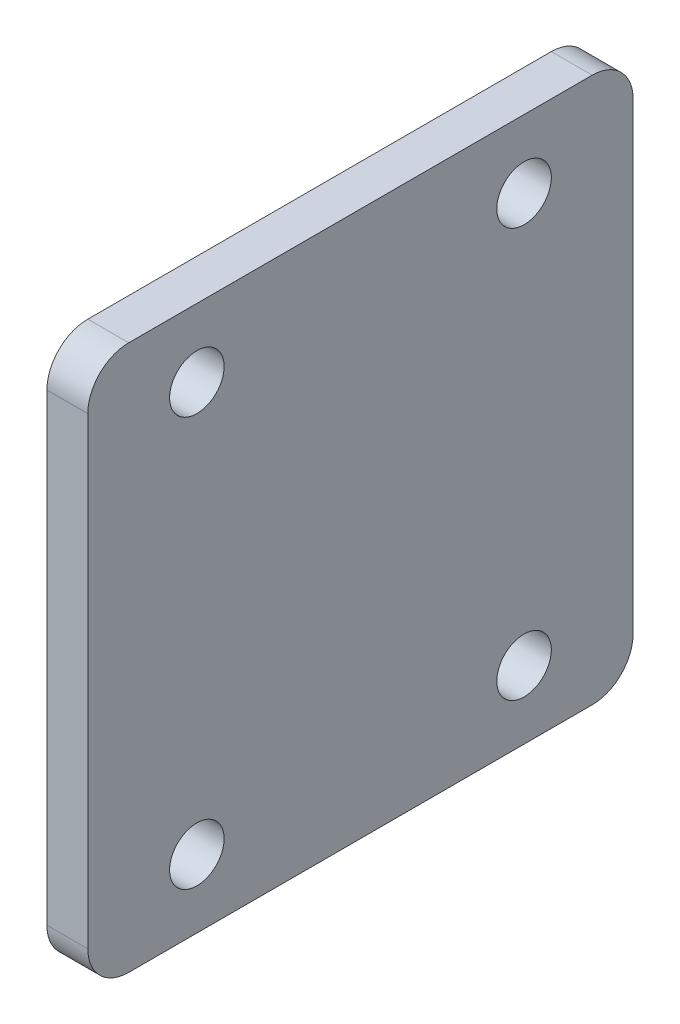
ISO-10303-21;
HEADER;
FILE_DESCRIPTION(('STEP AP214'),'2;1');
FILE_NAME('part.step','',(''),(''),'','','');
FILE_SCHEMA(('AUTOMOTIVE_DESIGN { 1 0 10303 214 1 1 1 1 }'));
ENDSEC;
DATA;
#1=APPLICATION_CONTEXT('core data for automotive mechanical design processes');
#2=APPLICATION_PROTOCOL_DEFINITION('international standard','automotive_design',2000,#1);
#3=PRODUCT_CONTEXT('',#1,'mechanical');
#4=PRODUCT('Part','Part','',(#3));
#5=PRODUCT_RELATED_PRODUCT_CATEGORY('part','',(#4));
#6=PRODUCT_DEFINITION_FORMATION('','',#4);
#7=PRODUCT_DEFINITION_CONTEXT('part definition',#1,'design');
#8=PRODUCT_DEFINITION('design','',#6,#7);
#9=PRODUCT_DEFINITION_SHAPE('','',#8);
#10=(LENGTH_UNIT() NAMED_UNIT(*) SI_UNIT(.MILLI.,.METRE.));
#11=(NAMED_UNIT(*) PLANE_ANGLE_UNIT() SI_UNIT($,.RADIAN.));
#12=(NAMED_UNIT(*) SI_UNIT($,.STERADIAN.) SOLID_ANGLE_UNIT());
#13=UNCERTAINTY_MEASURE_WITH_UNIT(LENGTH_MEASURE(1.E-05),#10,'distance_accuracy_value','');
#14=(GEOMETRIC_REPRESENTATION_CONTEXT(3) GLOBAL_UNCERTAINTY_ASSIGNED_CONTEXT((#13)) GLOBAL_UNIT_ASSIGNED_CONTEXT((#10,
#11,#12)) REPRESENTATION_CONTEXT('',''));
#15=CARTESIAN_POINT('',(0.,0.,0.));
#16=DIRECTION('',(0.,0.,1.));
#17=DIRECTION('',(1.,0.,0.));
#18=AXIS2_PLACEMENT_3D('',#15,#16,#17);
#19=CARTESIAN_POINT('',(-29.0517455341106,1220.26171759858,-56.1631389664354));
#20=DIRECTION('',(0.,0.,1.));
#21=DIRECTION('',(0.,-1.,0.));
#22=AXIS2_PLACEMENT_3D('',#19,#20,#21);
#23=PLANE('',#22);
#24=DIRECTION('',(0.,-1.,0.));
#25=VECTOR('',#24,1.);
#26=CARTESIAN_POINT('',(-26.0517455341106,1220.26171759858,-56.1631389664354));
#27=LINE('',#26,#25);
#28=CARTESIAN_POINT('',(-26.0517455341106,1217.26171759858,-56.1631389664354));
#29=VERTEX_POINT('',#28);
#30=CARTESIAN_POINT('',(-26.0517455341106,1183.26171759858,-56.1631389664354));
#31=VERTEX_POINT('',#30);
#32=EDGE_CURVE('E128',#29,#31,#27,.T.);
#33=ORIENTED_EDGE('',*,*,#32,.T.);
#34=DIRECTION('',(1.,0.,0.));
#35=VECTOR('',#34,1.);
#36=CARTESIAN_POINT('',(-29.0517455341106,1183.26171759858,-56.1631389664354));
#37=LINE('',#36,#35);
#38=CARTESIAN_POINT('',(-29.0517455341106,1183.26171759858,-56.1631389664354));
#39=VERTEX_POINT('',#38);
#40=EDGE_CURVE('E151',#31,#39,#37,.F.);
#41=ORIENTED_EDGE('',*,*,#40,.T.);
#42=DIRECTION('',(0.,-1.,0.));
#43=VECTOR('',#42,1.);
#44=CARTESIAN_POINT('',(-29.0517455341106,1220.26171759858,-56.1631389664354));
#45=LINE('',#44,#43);
#46=CARTESIAN_POINT('',(-29.0517455341106,1217.26171759858,-56.1631389664354));
#47=VERTEX_POINT('',#46);
#48=EDGE_CURVE('E126',#47,#39,#45,.T.);
#49=ORIENTED_EDGE('',*,*,#48,.F.);
#50=DIRECTION('',(1.,0.,0.));
#51=VECTOR('',#50,1.);
#52=CARTESIAN_POINT('',(-29.0517455341106,1217.26171759858,-56.1631389664354));
#53=LINE('',#52,#51);
#54=EDGE_CURVE('E148',#47,#29,#53,.T.);
#55=ORIENTED_EDGE('',*,*,#54,.T.);
#56=EDGE_LOOP('',(#33,#41,#49,#55));
#57=FACE_BOUND('',#56,.T.);
#58=ADVANCED_FACE('F33',(#57),#23,.F.);
#59=CARTESIAN_POINT('',(-29.0517455341106,1180.26171759858,-56.1631389664354));
#60=DIRECTION('',(0.,1.,0.));
#61=DIRECTION('',(0.,0.,1.));
#62=AXIS2_PLACEMENT_3D('',#59,#60,#61);
#63=PLANE('',#62);
#64=DIRECTION('',(0.,0.,1.));
#65=VECTOR('',#64,1.);
#66=CARTESIAN_POINT('',(-26.0517455341106,1180.26171759858,-56.1631389664354));
#67=LINE('',#66,#65);
#68=CARTESIAN_POINT('',(-26.0517455341106,1180.26171759858,-53.1631389664354));
#69=VERTEX_POINT('',#68);
#70=CARTESIAN_POINT('',(-26.0517455341106,1180.26171759858,-19.1631389664354));
#71=VERTEX_POINT('',#70);
#72=EDGE_CURVE('E124',#69,#71,#67,.T.);
#73=ORIENTED_EDGE('',*,*,#72,.T.);
#74=DIRECTION('',(1.,0.,0.));
#75=VECTOR('',#74,1.);
#76=CARTESIAN_POINT('',(-29.0517455341106,1180.26171759858,-19.1631389664354));
#77=LINE('',#76,#75);
#78=CARTESIAN_POINT('',(-29.0517455341106,1180.26171759858,-19.1631389664354));
#79=VERTEX_POINT('',#78);
#80=EDGE_CURVE('E103',#71,#79,#77,.F.);
#81=ORIENTED_EDGE('',*,*,#80,.T.);
#82=DIRECTION('',(0.,0.,1.));
#83=VECTOR('',#82,1.);
#84=CARTESIAN_POINT('',(-29.0517455341106,1180.26171759858,-56.1631389664354));
#85=LINE('',#84,#83);
#86=CARTESIAN_POINT('',(-29.0517455341106,1180.26171759858,-53.1631389664354));
#87=VERTEX_POINT('',#86);
#88=EDGE_CURVE('E167',#87,#79,#85,.T.);
#89=ORIENTED_EDGE('',*,*,#88,.F.);
#90=DIRECTION('',(1.,0.,0.));
#91=VECTOR('',#90,1.);
#92=CARTESIAN_POINT('',(-29.0517455341106,1180.26171759858,-53.1631389664354));
#93=LINE('',#92,#91);
#94=EDGE_CURVE('E108',#87,#69,#93,.T.);
#95=ORIENTED_EDGE('',*,*,#94,.T.);
#96=EDGE_LOOP('',(#73,#81,#89,#95));
#97=FACE_BOUND('',#96,.T.);
#98=ADVANCED_FACE('F217',(#97),#63,.F.);
#99=CARTESIAN_POINT('',(-29.0517455341106,1220.26171759858,-16.1631389664354));
#100=DIRECTION('',(0.,0.,-1.));
#101=DIRECTION('',(0.,1.,0.));
#102=AXIS2_PLACEMENT_3D('',#99,#100,#101);
#103=PLANE('',#102);
#104=DIRECTION('',(0.,1.,0.));
#105=VECTOR('',#104,1.);
#106=CARTESIAN_POINT('',(-29.0517455341106,1220.26171759858,-16.1631389664354));
#107=LINE('',#106,#105);
#108=CARTESIAN_POINT('',(-29.0517455341106,1183.26171759858,-16.1631389664354));
#109=VERTEX_POINT('',#108);
#110=CARTESIAN_POINT('',(-29.0517455341106,1217.26171759858,-16.1631389664354));
#111=VERTEX_POINT('',#110);
#112=EDGE_CURVE('E117',#109,#111,#107,.T.);
#113=ORIENTED_EDGE('',*,*,#112,.F.);
#114=DIRECTION('',(1.,0.,0.));
#115=VECTOR('',#114,1.);
#116=CARTESIAN_POINT('',(-29.0517455341106,1183.26171759858,-16.1631389664354));
#117=LINE('',#116,#115);
#118=CARTESIAN_POINT('',(-26.0517455341106,1183.26171759858,-16.1631389664354));
#119=VERTEX_POINT('',#118);
#120=EDGE_CURVE('E102',#109,#119,#117,.T.);
#121=ORIENTED_EDGE('',*,*,#120,.T.);
#122=DIRECTION('',(0.,1.,0.));
#123=VECTOR('',#122,1.);
#124=CARTESIAN_POINT('',(-26.0517455341106,1220.26171759858,-16.1631389664354));
#125=LINE('',#124,#123);
#126=CARTESIAN_POINT('',(-26.0517455341106,1217.26171759858,-16.1631389664354));
#127=VERTEX_POINT('',#126);
#128=EDGE_CURVE('E115',#119,#127,#125,.T.);
#129=ORIENTED_EDGE('',*,*,#128,.T.);
#130=DIRECTION('',(1.,0.,0.));
#131=VECTOR('',#130,1.);
#132=CARTESIAN_POINT('',(-29.0517455341106,1217.26171759858,-16.1631389664354));
#133=LINE('',#132,#131);
#134=EDGE_CURVE('E119',#127,#111,#133,.F.);
#135=ORIENTED_EDGE('',*,*,#134,.T.);
#136=EDGE_LOOP('',(#113,#121,#129,#135));
#137=FACE_BOUND('',#136,.T.);
#138=ADVANCED_FACE('F114',(#137),#103,.F.);
#139=CARTESIAN_POINT('',(-29.0517455341106,1220.26171759858,-56.1631389664354));
#140=DIRECTION('',(0.,-1.,0.));
#141=DIRECTION('',(0.,0.,-1.));
#142=AXIS2_PLACEMENT_3D('',#139,#140,#141);
#143=PLANE('',#142);
#144=DIRECTION('',(0.,0.,-1.));
#145=VECTOR('',#144,1.);
#146=CARTESIAN_POINT('',(-26.0517455341106,1220.26171759858,-56.1631389664354));
#147=LINE('',#146,#145);
#148=CARTESIAN_POINT('',(-26.0517455341106,1220.26171759858,-19.1631389664354));
#149=VERTEX_POINT('',#148);
#150=CARTESIAN_POINT('',(-26.0517455341106,1220.26171759858,-53.1631389664354));
#151=VERTEX_POINT('',#150);
#152=EDGE_CURVE('E123',#149,#151,#147,.T.);
#153=ORIENTED_EDGE('',*,*,#152,.T.);
#154=DIRECTION('',(1.,0.,0.));
#155=VECTOR('',#154,1.);
#156=CARTESIAN_POINT('',(-29.0517455341106,1220.26171759858,-53.1631389664354));
#157=LINE('',#156,#155);
#158=CARTESIAN_POINT('',(-29.0517455341106,1220.26171759858,-53.1631389664354));
#159=VERTEX_POINT('',#158);
#160=EDGE_CURVE('E11',#151,#159,#157,.F.);
#161=ORIENTED_EDGE('',*,*,#160,.T.);
#162=DIRECTION('',(0.,0.,-1.));
#163=VECTOR('',#162,1.);
#164=CARTESIAN_POINT('',(-29.0517455341106,1220.26171759858,-56.1631389664354));
#165=LINE('',#164,#163);
#166=CARTESIAN_POINT('',(-29.0517455341106,1220.26171759858,-19.1631389664354));
#167=VERTEX_POINT('',#166);
#168=EDGE_CURVE('E132',#167,#159,#165,.T.);
#169=ORIENTED_EDGE('',*,*,#168,.F.);
#170=DIRECTION('',(1.,0.,0.));
#171=VECTOR('',#170,1.);
#172=CARTESIAN_POINT('',(-29.0517455341106,1220.26171759858,-19.1631389664354));
#173=LINE('',#172,#171);
#174=EDGE_CURVE('E41',#167,#149,#173,.T.);
#175=ORIENTED_EDGE('',*,*,#174,.T.);
#176=EDGE_LOOP('',(#153,#161,#169,#175));
#177=FACE_BOUND('',#176,.T.);
#178=ADVANCED_FACE('F154',(#177),#143,.F.);
#179=CARTESIAN_POINT('',(-29.0517455341106,1180.26171759858,-56.1631389664354));
#180=DIRECTION('',(-1.,0.,0.));
#181=DIRECTION('',(0.,0.,1.));
#182=AXIS2_PLACEMENT_3D('',#179,#180,#181);
#183=PLANE('',#182);
#184=CARTESIAN_POINT('',(-29.0517455341106,1185.26171759858,-48.1631389664354));
#185=DIRECTION('',(-1.,0.,0.));
#186=DIRECTION('',(0.,0.,1.));
#187=AXIS2_PLACEMENT_3D('',#184,#185,#186);
#188=CIRCLE('',#187,2.);
#189=CARTESIAN_POINT('',(-29.0517455341106,1185.26171759858,-46.1631389664354));
#190=VERTEX_POINT('',#189);
#191=EDGE_CURVE('E199',#190,#190,#188,.T.);
#192=ORIENTED_EDGE('',*,*,#191,.F.);
#193=EDGE_LOOP('',(#192));
#194=FACE_BOUND('',#193,.T.);
#195=CARTESIAN_POINT('',(-29.0517455341106,1185.26171759858,-24.1631389664354));
#196=DIRECTION('',(-1.,0.,0.));
#197=DIRECTION('',(0.,0.,1.));
#198=AXIS2_PLACEMENT_3D('',#195,#196,#197);
#199=CIRCLE('',#198,2.);
#200=CARTESIAN_POINT('',(-29.0517455341106,1185.26171759858,-22.1631389664354));
#201=VERTEX_POINT('',#200);
#202=EDGE_CURVE('E193',#201,#201,#199,.T.);
#203=ORIENTED_EDGE('',*,*,#202,.F.);
#204=EDGE_LOOP('',(#203));
#205=FACE_BOUND('',#204,.T.);
#206=CARTESIAN_POINT('',(-29.0517455341106,1215.26171759858,-24.1631389664354));
#207=DIRECTION('',(-1.,0.,0.));
#208=DIRECTION('',(0.,0.,1.));
#209=AXIS2_PLACEMENT_3D('',#206,#207,#208);
#210=CIRCLE('',#209,2.);
#211=CARTESIAN_POINT('',(-29.0517455341106,1215.26171759858,-22.1631389664354));
#212=VERTEX_POINT('',#211);
#213=EDGE_CURVE('E185',#212,#212,#210,.T.);
#214=ORIENTED_EDGE('',*,*,#213,.F.);
#215=EDGE_LOOP('',(#214));
#216=FACE_BOUND('',#215,.T.);
#217=CARTESIAN_POINT('',(-29.0517455341106,1215.26171759858,-48.1631389664354));
#218=DIRECTION('',(-1.,0.,0.));
#219=DIRECTION('',(0.,0.,1.));
#220=AXIS2_PLACEMENT_3D('',#217,#218,#219);
#221=CIRCLE('',#220,2.);
#222=CARTESIAN_POINT('',(-29.0517455341106,1215.26171759858,-46.1631389664354));
#223=VERTEX_POINT('',#222);
#224=EDGE_CURVE('E177',#223,#223,#221,.T.);
#225=ORIENTED_EDGE('',*,*,#224,.F.);
#226=EDGE_LOOP('',(#225));
#227=FACE_BOUND('',#226,.T.);
#228=ORIENTED_EDGE('',*,*,#88,.T.);
#229=CARTESIAN_POINT('',(-29.0517455341106,1183.26171759858,-19.1631389664354));
#230=DIRECTION('',(-1.,0.,0.));
#231=DIRECTION('',(0.,0.,1.));
#232=AXIS2_PLACEMENT_3D('',#229,#230,#231);
#233=CIRCLE('',#232,3.);
#234=EDGE_CURVE('E146',#79,#109,#233,.T.);
#235=ORIENTED_EDGE('',*,*,#234,.T.);
#236=ORIENTED_EDGE('',*,*,#112,.T.);
#237=CARTESIAN_POINT('',(-29.0517455341106,1217.26171759858,-19.1631389664354));
#238=DIRECTION('',(-1.,0.,0.));
#239=DIRECTION('',(0.,0.,1.));
#240=AXIS2_PLACEMENT_3D('',#237,#238,#239);
#241=CIRCLE('',#240,3.);
#242=EDGE_CURVE('E53',#111,#167,#241,.T.);
#243=ORIENTED_EDGE('',*,*,#242,.T.);
#244=ORIENTED_EDGE('',*,*,#168,.T.);
#245=CARTESIAN_POINT('',(-29.0517455341106,1217.26171759858,-53.1631389664354));
#246=DIRECTION('',(-1.,0.,0.));
#247=DIRECTION('',(0.,0.,1.));
#248=AXIS2_PLACEMENT_3D('',#245,#246,#247);
#249=CIRCLE('',#248,3.);
#250=EDGE_CURVE('E142',#159,#47,#249,.T.);
#251=ORIENTED_EDGE('',*,*,#250,.T.);
#252=ORIENTED_EDGE('',*,*,#48,.T.);
#253=CARTESIAN_POINT('',(-29.0517455341106,1183.26171759858,-53.1631389664354));
#254=DIRECTION('',(-1.,0.,0.));
#255=DIRECTION('',(0.,0.,1.));
#256=AXIS2_PLACEMENT_3D('',#253,#254,#255);
#257=CIRCLE('',#256,3.);
#258=EDGE_CURVE('E144',#39,#87,#257,.T.);
#259=ORIENTED_EDGE('',*,*,#258,.T.);
#260=EDGE_LOOP('',(#228,#235,#236,#243,#244,#251,#252,#259));
#261=FACE_BOUND('',#260,.T.);
#262=ADVANCED_FACE('F206',(#194,#205,#216,#227,#261),#183,.T.);
#263=CARTESIAN_POINT('',(-26.0517455341106,1180.26171759858,-56.1631389664354));
#264=DIRECTION('',(-1.,0.,0.));
#265=DIRECTION('',(0.,0.,1.));
#266=AXIS2_PLACEMENT_3D('',#263,#264,#265);
#267=PLANE('',#266);
#268=CARTESIAN_POINT('',(-26.0517455341106,1185.26171759858,-48.1631389664354));
#269=DIRECTION('',(-1.,0.,0.));
#270=DIRECTION('',(0.,0.,1.));
#271=AXIS2_PLACEMENT_3D('',#268,#269,#270);
#272=CIRCLE('',#271,2.);
#273=CARTESIAN_POINT('',(-26.0517455341106,1185.26171759858,-46.1631389664354));
#274=VERTEX_POINT('',#273);
#275=EDGE_CURVE('E196',#274,#274,#272,.F.);
#276=ORIENTED_EDGE('',*,*,#275,.F.);
#277=EDGE_LOOP('',(#276));
#278=FACE_BOUND('',#277,.T.);
#279=CARTESIAN_POINT('',(-26.0517455341106,1185.26171759858,-24.1631389664354));
#280=DIRECTION('',(-1.,0.,0.));
#281=DIRECTION('',(0.,0.,1.));
#282=AXIS2_PLACEMENT_3D('',#279,#280,#281);
#283=CIRCLE('',#282,2.);
#284=CARTESIAN_POINT('',(-26.0517455341106,1185.26171759858,-22.1631389664354));
#285=VERTEX_POINT('',#284);
#286=EDGE_CURVE('E190',#285,#285,#283,.F.);
#287=ORIENTED_EDGE('',*,*,#286,.F.);
#288=EDGE_LOOP('',(#287));
#289=FACE_BOUND('',#288,.T.);
#290=CARTESIAN_POINT('',(-26.0517455341106,1215.26171759858,-24.1631389664354));
#291=DIRECTION('',(-1.,0.,0.));
#292=DIRECTION('',(0.,0.,1.));
#293=AXIS2_PLACEMENT_3D('',#290,#291,#292);
#294=CIRCLE('',#293,2.);
#295=CARTESIAN_POINT('',(-26.0517455341106,1215.26171759858,-22.1631389664354));
#296=VERTEX_POINT('',#295);
#297=EDGE_CURVE('E181',#296,#296,#294,.F.);
#298=ORIENTED_EDGE('',*,*,#297,.F.);
#299=EDGE_LOOP('',(#298));
#300=FACE_BOUND('',#299,.T.);
#301=CARTESIAN_POINT('',(-26.0517455341106,1215.26171759858,-48.1631389664354));
#302=DIRECTION('',(-1.,0.,0.));
#303=DIRECTION('',(0.,0.,1.));
#304=AXIS2_PLACEMENT_3D('',#301,#302,#303);
#305=CIRCLE('',#304,2.);
#306=CARTESIAN_POINT('',(-26.0517455341106,1215.26171759858,-46.1631389664354));
#307=VERTEX_POINT('',#306);
#308=EDGE_CURVE('E172',#307,#307,#305,.F.);
#309=ORIENTED_EDGE('',*,*,#308,.F.);
#310=EDGE_LOOP('',(#309));
#311=FACE_BOUND('',#310,.T.);
#312=ORIENTED_EDGE('',*,*,#128,.F.);
#313=CARTESIAN_POINT('',(-26.0517455341106,1183.26171759858,-19.1631389664354));
#314=DIRECTION('',(-1.,0.,0.));
#315=DIRECTION('',(0.,0.,1.));
#316=AXIS2_PLACEMENT_3D('',#313,#314,#315);
#317=CIRCLE('',#316,3.);
#318=EDGE_CURVE('E98',#119,#71,#317,.F.);
#319=ORIENTED_EDGE('',*,*,#318,.T.);
#320=ORIENTED_EDGE('',*,*,#72,.F.);
#321=CARTESIAN_POINT('',(-26.0517455341106,1183.26171759858,-53.1631389664354));
#322=DIRECTION('',(-1.,0.,0.));
#323=DIRECTION('',(0.,0.,1.));
#324=AXIS2_PLACEMENT_3D('',#321,#322,#323);
#325=CIRCLE('',#324,3.);
#326=EDGE_CURVE('E109',#69,#31,#325,.F.);
#327=ORIENTED_EDGE('',*,*,#326,.T.);
#328=ORIENTED_EDGE('',*,*,#32,.F.);
#329=CARTESIAN_POINT('',(-26.0517455341106,1217.26171759858,-53.1631389664354));
#330=DIRECTION('',(-1.,0.,0.));
#331=DIRECTION('',(0.,0.,1.));
#332=AXIS2_PLACEMENT_3D('',#329,#330,#331);
#333=CIRCLE('',#332,3.);
#334=EDGE_CURVE('E135',#29,#151,#333,.F.);
#335=ORIENTED_EDGE('',*,*,#334,.T.);
#336=ORIENTED_EDGE('',*,*,#152,.F.);
#337=CARTESIAN_POINT('',(-26.0517455341106,1217.26171759858,-19.1631389664354));
#338=DIRECTION('',(-1.,0.,0.));
#339=DIRECTION('',(0.,0.,1.));
#340=AXIS2_PLACEMENT_3D('',#337,#338,#339);
#341=CIRCLE('',#340,3.);
#342=EDGE_CURVE('E118',#149,#127,#341,.F.);
#343=ORIENTED_EDGE('',*,*,#342,.T.);
#344=EDGE_LOOP('',(#312,#319,#320,#327,#328,#335,#336,#343));
#345=FACE_BOUND('',#344,.T.);
#346=ADVANCED_FACE('F121',(#278,#289,#300,#311,#345),#267,.F.);
#347=CARTESIAN_POINT('',(-29.0517455341106,1183.26171759858,-19.1631389664354));
#348=DIRECTION('',(1.,0.,0.));
#349=DIRECTION('',(0.,0.,-1.));
#350=AXIS2_PLACEMENT_3D('',#347,#348,#349);
#351=CYLINDRICAL_SURFACE('',#350,3.);
#352=ORIENTED_EDGE('',*,*,#234,.F.);
#353=ORIENTED_EDGE('',*,*,#80,.F.);
#354=ORIENTED_EDGE('',*,*,#318,.F.);
#355=ORIENTED_EDGE('',*,*,#120,.F.);
#356=EDGE_LOOP('',(#352,#353,#354,#355));
#357=FACE_BOUND('',#356,.T.);
#358=ADVANCED_FACE('F101',(#357),#351,.T.);
#359=CARTESIAN_POINT('',(-29.0517455341106,1183.26171759858,-53.1631389664354));
#360=DIRECTION('',(1.,0.,0.));
#361=DIRECTION('',(0.,0.,-1.));
#362=AXIS2_PLACEMENT_3D('',#359,#360,#361);
#363=CYLINDRICAL_SURFACE('',#362,3.);
#364=ORIENTED_EDGE('',*,*,#258,.F.);
#365=ORIENTED_EDGE('',*,*,#40,.F.);
#366=ORIENTED_EDGE('',*,*,#326,.F.);
#367=ORIENTED_EDGE('',*,*,#94,.F.);
#368=EDGE_LOOP('',(#364,#365,#366,#367));
#369=FACE_BOUND('',#368,.T.);
#370=ADVANCED_FACE('F219',(#369),#363,.T.);
#371=CARTESIAN_POINT('',(-29.0517455341106,1217.26171759858,-53.1631389664354));
#372=DIRECTION('',(1.,0.,0.));
#373=DIRECTION('',(0.,0.,-1.));
#374=AXIS2_PLACEMENT_3D('',#371,#372,#373);
#375=CYLINDRICAL_SURFACE('',#374,3.);
#376=ORIENTED_EDGE('',*,*,#250,.F.);
#377=ORIENTED_EDGE('',*,*,#160,.F.);
#378=ORIENTED_EDGE('',*,*,#334,.F.);
#379=ORIENTED_EDGE('',*,*,#54,.F.);
#380=EDGE_LOOP('',(#376,#377,#378,#379));
#381=FACE_BOUND('',#380,.T.);
#382=ADVANCED_FACE('F161',(#381),#375,.T.);
#383=CARTESIAN_POINT('',(-29.0517455341106,1217.26171759858,-19.1631389664354));
#384=DIRECTION('',(1.,0.,0.));
#385=DIRECTION('',(0.,0.,-1.));
#386=AXIS2_PLACEMENT_3D('',#383,#384,#385);
#387=CYLINDRICAL_SURFACE('',#386,3.);
#388=ORIENTED_EDGE('',*,*,#242,.F.);
#389=ORIENTED_EDGE('',*,*,#134,.F.);
#390=ORIENTED_EDGE('',*,*,#342,.F.);
#391=ORIENTED_EDGE('',*,*,#174,.F.);
#392=EDGE_LOOP('',(#388,#389,#390,#391));
#393=FACE_BOUND('',#392,.T.);
#394=ADVANCED_FACE('F35',(#393),#387,.T.);
#395=CARTESIAN_POINT('',(-26.0507455341106,1215.26171759858,-48.1631389664354));
#396=DIRECTION('',(-1.,0.,0.));
#397=DIRECTION('',(0.,0.,1.));
#398=AXIS2_PLACEMENT_3D('',#395,#396,#397);
#399=CYLINDRICAL_SURFACE('',#398,2.);
#400=ORIENTED_EDGE('',*,*,#224,.T.);
#401=EDGE_LOOP('',(#400));
#402=FACE_BOUND('',#401,.T.);
#403=ORIENTED_EDGE('',*,*,#308,.T.);
#404=EDGE_LOOP('',(#403));
#405=FACE_BOUND('',#404,.T.);
#406=ADVANCED_FACE('F241',(#402,#405),#399,.F.);
#407=CARTESIAN_POINT('',(-26.0507455341106,1215.26171759858,-24.1631389664354));
#408=DIRECTION('',(-1.,0.,0.));
#409=DIRECTION('',(0.,0.,1.));
#410=AXIS2_PLACEMENT_3D('',#407,#408,#409);
#411=CYLINDRICAL_SURFACE('',#410,2.);
#412=ORIENTED_EDGE('',*,*,#213,.T.);
#413=EDGE_LOOP('',(#412));
#414=FACE_BOUND('',#413,.T.);
#415=ORIENTED_EDGE('',*,*,#297,.T.);
#416=EDGE_LOOP('',(#415));
#417=FACE_BOUND('',#416,.T.);
#418=ADVANCED_FACE('F244',(#414,#417),#411,.F.);
#419=CARTESIAN_POINT('',(-26.0507455341106,1185.26171759858,-24.1631389664354));
#420=DIRECTION('',(-1.,0.,0.));
#421=DIRECTION('',(0.,0.,1.));
#422=AXIS2_PLACEMENT_3D('',#419,#420,#421);
#423=CYLINDRICAL_SURFACE('',#422,2.);
#424=ORIENTED_EDGE('',*,*,#202,.T.);
#425=EDGE_LOOP('',(#424));
#426=FACE_BOUND('',#425,.T.);
#427=ORIENTED_EDGE('',*,*,#286,.T.);
#428=EDGE_LOOP('',(#427));
#429=FACE_BOUND('',#428,.T.);
#430=ADVANCED_FACE('F247',(#426,#429),#423,.F.);
#431=CARTESIAN_POINT('',(-26.0507455341106,1185.26171759858,-48.1631389664354));
#432=DIRECTION('',(-1.,0.,0.));
#433=DIRECTION('',(0.,0.,1.));
#434=AXIS2_PLACEMENT_3D('',#431,#432,#433);
#435=CYLINDRICAL_SURFACE('',#434,2.);
#436=ORIENTED_EDGE('',*,*,#191,.T.);
#437=EDGE_LOOP('',(#436));
#438=FACE_BOUND('',#437,.T.);
#439=ORIENTED_EDGE('',*,*,#275,.T.);
#440=EDGE_LOOP('',(#439));
#441=FACE_BOUND('',#440,.T.);
#442=ADVANCED_FACE('F203',(#438,#441),#435,.F.);
#443=CLOSED_SHELL('',(#58,#98,#138,#178,#262,#346,#358,#370,#382,#394,#406,#418,#430,#442));
#444=MANIFOLD_SOLID_BREP('B2',#443);
#445=ADVANCED_BREP_SHAPE_REPRESENTATION('',(#18,#444),#14);
#446=SHAPE_DEFINITION_REPRESENTATION(#9,#445);
ENDSEC;
END-ISO-10303-21;
